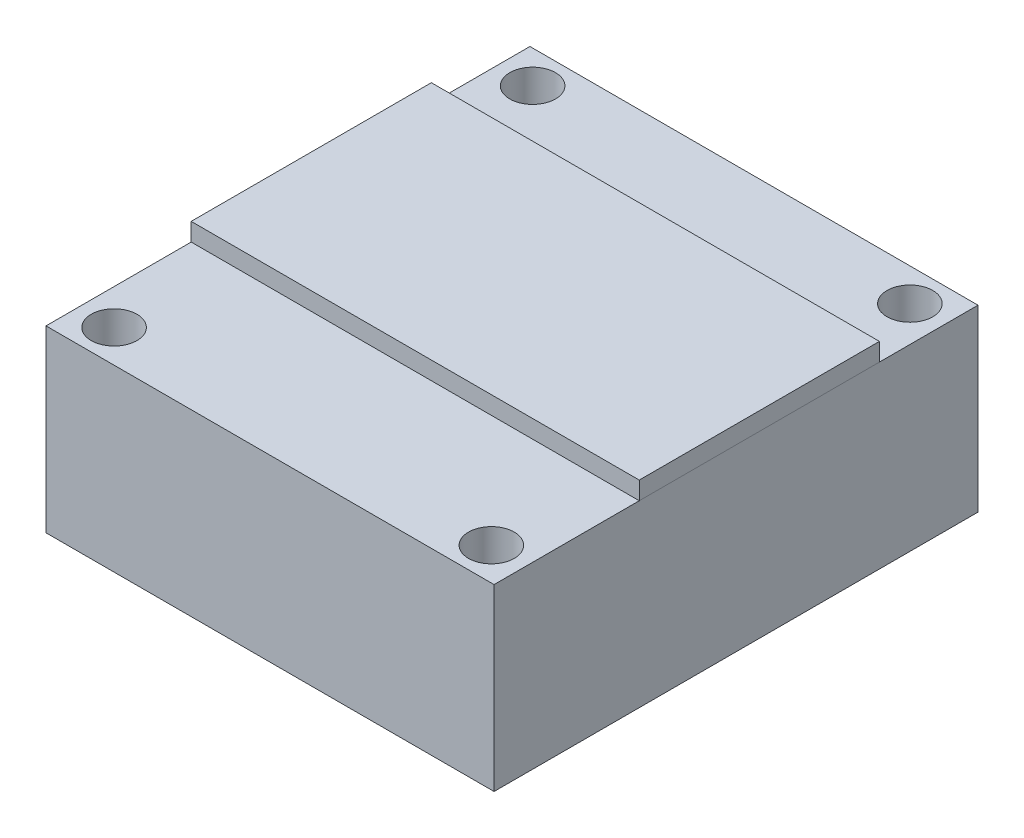
ISO-10303-21;
HEADER;
FILE_DESCRIPTION(('STEP AP214'),'2;1');
FILE_NAME('part.step','',(''),(''),'','','');
FILE_SCHEMA(('AUTOMOTIVE_DESIGN { 1 0 10303 214 1 1 1 1 }'));
ENDSEC;
DATA;
#1=APPLICATION_CONTEXT('core data for automotive mechanical design processes');
#2=APPLICATION_PROTOCOL_DEFINITION('international standard','automotive_design',2000,#1);
#3=PRODUCT_CONTEXT('',#1,'mechanical');
#4=PRODUCT('Part','Part','',(#3));
#5=PRODUCT_RELATED_PRODUCT_CATEGORY('part','',(#4));
#6=PRODUCT_DEFINITION_FORMATION('','',#4);
#7=PRODUCT_DEFINITION_CONTEXT('part definition',#1,'design');
#8=PRODUCT_DEFINITION('design','',#6,#7);
#9=PRODUCT_DEFINITION_SHAPE('','',#8);
#10=(LENGTH_UNIT() NAMED_UNIT(*) SI_UNIT(.MILLI.,.METRE.));
#11=(NAMED_UNIT(*) PLANE_ANGLE_UNIT() SI_UNIT($,.RADIAN.));
#12=(NAMED_UNIT(*) SI_UNIT($,.STERADIAN.) SOLID_ANGLE_UNIT());
#13=UNCERTAINTY_MEASURE_WITH_UNIT(LENGTH_MEASURE(1.E-05),#10,'distance_accuracy_value','');
#14=(GEOMETRIC_REPRESENTATION_CONTEXT(3) GLOBAL_UNCERTAINTY_ASSIGNED_CONTEXT((#13)) GLOBAL_UNIT_ASSIGNED_CONTEXT((#10,
#11,#12)) REPRESENTATION_CONTEXT('',''));
#15=CARTESIAN_POINT('',(0.,0.,0.));
#16=DIRECTION('',(0.,0.,1.));
#17=DIRECTION('',(1.,0.,0.));
#18=AXIS2_PLACEMENT_3D('',#15,#16,#17);
#19=CARTESIAN_POINT('',(77.1591269636206,11.,33.7846010335148));
#20=DIRECTION('',(-1.,0.,0.));
#21=DIRECTION('',(0.,0.,1.));
#22=AXIS2_PLACEMENT_3D('',#19,#20,#21);
#23=PLANE('',#22);
#24=DIRECTION('',(0.,0.,-1.));
#25=VECTOR('',#24,1.);
#26=CARTESIAN_POINT('',(77.1591269636206,10.,33.7846010335148));
#27=LINE('',#26,#25);
#28=CARTESIAN_POINT('',(77.1591269636206,10.,33.7846010335148));
#29=VERTEX_POINT('',#28);
#30=CARTESIAN_POINT('',(77.1591269636206,10.,20.3846010335148));
#31=VERTEX_POINT('',#30);
#32=EDGE_CURVE('E120',#29,#31,#27,.T.);
#33=ORIENTED_EDGE('',*,*,#32,.T.);
#34=DIRECTION('',(0.,-1.,0.));
#35=VECTOR('',#34,1.);
#36=CARTESIAN_POINT('',(77.1591269636206,11.,20.3846010335148));
#37=LINE('',#36,#35);
#38=CARTESIAN_POINT('',(77.1591269636206,11.,20.3846010335148));
#39=VERTEX_POINT('',#38);
#40=EDGE_CURVE('E12',#39,#31,#37,.T.);
#41=ORIENTED_EDGE('',*,*,#40,.F.);
#42=DIRECTION('',(0.,0.,-1.));
#43=VECTOR('',#42,1.);
#44=CARTESIAN_POINT('',(77.1591269636206,11.,33.7846010335148));
#45=LINE('',#44,#43);
#46=CARTESIAN_POINT('',(77.1591269636206,11.,33.7846010335148));
#47=VERTEX_POINT('',#46);
#48=EDGE_CURVE('E108',#47,#39,#45,.T.);
#49=ORIENTED_EDGE('',*,*,#48,.F.);
#50=DIRECTION('',(0.,-1.,0.));
#51=VECTOR('',#50,1.);
#52=CARTESIAN_POINT('',(77.1591269636206,11.,33.7846010335148));
#53=LINE('',#52,#51);
#54=EDGE_CURVE('E116',#47,#29,#53,.T.);
#55=ORIENTED_EDGE('',*,*,#54,.T.);
#56=EDGE_LOOP('',(#33,#41,#49,#55));
#57=FACE_BOUND('',#56,.T.);
#58=ADVANCED_FACE('F57',(#57),#23,.F.);
#59=CARTESIAN_POINT('',(52.1591269636206,11.,20.3846010335148));
#60=DIRECTION('',(0.,0.,1.));
#61=DIRECTION('',(1.,0.,0.));
#62=AXIS2_PLACEMENT_3D('',#59,#60,#61);
#63=PLANE('',#62);
#64=DIRECTION('',(-1.,0.,0.));
#65=VECTOR('',#64,1.);
#66=CARTESIAN_POINT('',(52.1591269636206,10.,20.3846010335148));
#67=LINE('',#66,#65);
#68=CARTESIAN_POINT('',(52.1591269636206,10.,20.3846010335148));
#69=VERTEX_POINT('',#68);
#70=EDGE_CURVE('E112',#31,#69,#67,.T.);
#71=ORIENTED_EDGE('',*,*,#70,.T.);
#72=DIRECTION('',(0.,-1.,0.));
#73=VECTOR('',#72,1.);
#74=CARTESIAN_POINT('',(52.1591269636206,11.,20.3846010335148));
#75=LINE('',#74,#73);
#76=CARTESIAN_POINT('',(52.1591269636206,11.,20.3846010335148));
#77=VERTEX_POINT('',#76);
#78=EDGE_CURVE('E65',#77,#69,#75,.T.);
#79=ORIENTED_EDGE('',*,*,#78,.F.);
#80=DIRECTION('',(-1.,0.,0.));
#81=VECTOR('',#80,1.);
#82=CARTESIAN_POINT('',(52.1591269636206,11.,20.3846010335148));
#83=LINE('',#82,#81);
#84=EDGE_CURVE('E103',#39,#77,#83,.T.);
#85=ORIENTED_EDGE('',*,*,#84,.F.);
#86=ORIENTED_EDGE('',*,*,#40,.T.);
#87=EDGE_LOOP('',(#71,#79,#85,#86));
#88=FACE_BOUND('',#87,.T.);
#89=ADVANCED_FACE('F111',(#88),#63,.F.);
#90=CARTESIAN_POINT('',(52.1591269636206,11.,33.7846010335148));
#91=DIRECTION('',(1.,0.,0.));
#92=DIRECTION('',(0.,0.,-1.));
#93=AXIS2_PLACEMENT_3D('',#90,#91,#92);
#94=PLANE('',#93);
#95=DIRECTION('',(0.,0.,1.));
#96=VECTOR('',#95,1.);
#97=CARTESIAN_POINT('',(52.1591269636206,10.,33.7846010335148));
#98=LINE('',#97,#96);
#99=CARTESIAN_POINT('',(52.1591269636206,10.,33.7846010335148));
#100=VERTEX_POINT('',#99);
#101=EDGE_CURVE('E90',#69,#100,#98,.T.);
#102=ORIENTED_EDGE('',*,*,#101,.T.);
#103=DIRECTION('',(0.,-1.,0.));
#104=VECTOR('',#103,1.);
#105=CARTESIAN_POINT('',(52.1591269636206,11.,33.7846010335148));
#106=LINE('',#105,#104);
#107=CARTESIAN_POINT('',(52.1591269636206,11.,33.7846010335148));
#108=VERTEX_POINT('',#107);
#109=EDGE_CURVE('E113',#108,#100,#106,.T.);
#110=ORIENTED_EDGE('',*,*,#109,.F.);
#111=DIRECTION('',(0.,0.,1.));
#112=VECTOR('',#111,1.);
#113=CARTESIAN_POINT('',(52.1591269636206,11.,33.7846010335148));
#114=LINE('',#113,#112);
#115=EDGE_CURVE('E106',#77,#108,#114,.T.);
#116=ORIENTED_EDGE('',*,*,#115,.F.);
#117=ORIENTED_EDGE('',*,*,#78,.T.);
#118=EDGE_LOOP('',(#102,#110,#116,#117));
#119=FACE_BOUND('',#118,.T.);
#120=ADVANCED_FACE('F114',(#119),#94,.F.);
#121=CARTESIAN_POINT('',(52.1591269636206,11.,33.7846010335148));
#122=DIRECTION('',(0.,0.,-1.));
#123=DIRECTION('',(-1.,0.,0.));
#124=AXIS2_PLACEMENT_3D('',#121,#122,#123);
#125=PLANE('',#124);
#126=DIRECTION('',(1.,0.,0.));
#127=VECTOR('',#126,1.);
#128=CARTESIAN_POINT('',(52.1591269636206,10.,33.7846010335148));
#129=LINE('',#128,#127);
#130=EDGE_CURVE('E96',#100,#29,#129,.T.);
#131=ORIENTED_EDGE('',*,*,#130,.T.);
#132=ORIENTED_EDGE('',*,*,#54,.F.);
#133=DIRECTION('',(1.,0.,0.));
#134=VECTOR('',#133,1.);
#135=CARTESIAN_POINT('',(52.1591269636206,11.,33.7846010335148));
#136=LINE('',#135,#134);
#137=EDGE_CURVE('E73',#108,#47,#136,.T.);
#138=ORIENTED_EDGE('',*,*,#137,.F.);
#139=ORIENTED_EDGE('',*,*,#109,.T.);
#140=EDGE_LOOP('',(#131,#132,#138,#139));
#141=FACE_BOUND('',#140,.T.);
#142=ADVANCED_FACE('F127',(#141),#125,.F.);
#143=CARTESIAN_POINT('',(0.,11.,0.));
#144=DIRECTION('',(0.,-1.,0.));
#145=DIRECTION('',(0.,0.,-1.));
#146=AXIS2_PLACEMENT_3D('',#143,#144,#145);
#147=PLANE('',#146);
#148=ORIENTED_EDGE('',*,*,#48,.T.);
#149=ORIENTED_EDGE('',*,*,#84,.T.);
#150=ORIENTED_EDGE('',*,*,#115,.T.);
#151=ORIENTED_EDGE('',*,*,#137,.T.);
#152=EDGE_LOOP('',(#148,#149,#150,#151));
#153=FACE_BOUND('',#152,.T.);
#154=ADVANCED_FACE('F104',(#153),#147,.F.);
#155=CARTESIAN_POINT('',(0.,10.,0.));
#156=DIRECTION('',(0.,-1.,0.));
#157=DIRECTION('',(0.,0.,-1.));
#158=AXIS2_PLACEMENT_3D('',#155,#156,#157);
#159=PLANE('',#158);
#160=ORIENTED_EDGE('',*,*,#32,.F.);
#161=ORIENTED_EDGE('',*,*,#130,.F.);
#162=ORIENTED_EDGE('',*,*,#101,.F.);
#163=ORIENTED_EDGE('',*,*,#70,.F.);
#164=EDGE_LOOP('',(#160,#161,#162,#163));
#165=FACE_BOUND('',#164,.T.);
#166=ADVANCED_FACE('F130',(#165),#159,.T.);
#167=CLOSED_SHELL('',(#58,#89,#120,#142,#154,#166));
#168=MANIFOLD_SOLID_BREP('B2',#167);
#169=CARTESIAN_POINT('',(0.,10.,0.));
#170=DIRECTION('',(0.,1.,0.));
#171=DIRECTION('',(0.,0.,1.));
#172=AXIS2_PLACEMENT_3D('',#169,#170,#171);
#173=PLANE('',#172);
#174=CARTESIAN_POINT('',(75.1841269636205,10.,40.0596010335148));
#175=DIRECTION('',(0.,1.,0.));
#176=DIRECTION('',(0.,0.,1.));
#177=AXIS2_PLACEMENT_3D('',#174,#175,#176);
#178=CIRCLE('',#177,1.275);
#179=CARTESIAN_POINT('',(75.1841269636205,10.,41.3346010335148));
#180=VERTEX_POINT('',#179);
#181=EDGE_CURVE('E284',#180,#180,#178,.T.);
#182=ORIENTED_EDGE('',*,*,#181,.F.);
#183=EDGE_LOOP('',(#182));
#184=FACE_BOUND('',#183,.T.);
#185=CARTESIAN_POINT('',(54.1341269636206,10.,16.7096010335148));
#186=DIRECTION('',(0.,1.,0.));
#187=DIRECTION('',(0.,0.,1.));
#188=AXIS2_PLACEMENT_3D('',#185,#186,#187);
#189=CIRCLE('',#188,1.275);
#190=CARTESIAN_POINT('',(54.1341269636206,10.,17.9846010335148));
#191=VERTEX_POINT('',#190);
#192=EDGE_CURVE('E254',#191,#191,#189,.T.);
#193=ORIENTED_EDGE('',*,*,#192,.F.);
#194=EDGE_LOOP('',(#193));
#195=FACE_BOUND('',#194,.T.);
#196=DIRECTION('',(0.,0.,-1.));
#197=VECTOR('',#196,1.);
#198=CARTESIAN_POINT('',(77.1591269636206,10.,14.8846010335148));
#199=LINE('',#198,#197);
#200=CARTESIAN_POINT('',(77.1591269636206,10.,41.8846010335148));
#201=VERTEX_POINT('',#200);
#202=CARTESIAN_POINT('',(77.1591269636206,10.,14.8846010335148));
#203=VERTEX_POINT('',#202);
#204=EDGE_CURVE('E234',#201,#203,#199,.T.);
#205=ORIENTED_EDGE('',*,*,#204,.T.);
#206=DIRECTION('',(-1.,0.,0.));
#207=VECTOR('',#206,1.);
#208=CARTESIAN_POINT('',(52.1591269636206,10.,14.8846010335148));
#209=LINE('',#208,#207);
#210=CARTESIAN_POINT('',(52.1591269636206,10.,14.8846010335148));
#211=VERTEX_POINT('',#210);
#212=EDGE_CURVE('E229',#203,#211,#209,.T.);
#213=ORIENTED_EDGE('',*,*,#212,.T.);
#214=DIRECTION('',(0.,0.,1.));
#215=VECTOR('',#214,1.);
#216=CARTESIAN_POINT('',(52.1591269636206,10.,14.8846010335148));
#217=LINE('',#216,#215);
#218=CARTESIAN_POINT('',(52.1591269636206,10.,41.8846010335148));
#219=VERTEX_POINT('',#218);
#220=EDGE_CURVE('E232',#211,#219,#217,.T.);
#221=ORIENTED_EDGE('',*,*,#220,.T.);
#222=DIRECTION('',(1.,0.,0.));
#223=VECTOR('',#222,1.);
#224=CARTESIAN_POINT('',(52.1591269636206,10.,41.8846010335148));
#225=LINE('',#224,#223);
#226=EDGE_CURVE('E199',#219,#201,#225,.T.);
#227=ORIENTED_EDGE('',*,*,#226,.T.);
#228=EDGE_LOOP('',(#205,#213,#221,#227));
#229=FACE_BOUND('',#228,.T.);
#230=CARTESIAN_POINT('',(54.1341269636206,10.,40.0596010335148));
#231=DIRECTION('',(0.,1.,0.));
#232=DIRECTION('',(0.,0.,-1.));
#233=AXIS2_PLACEMENT_3D('',#230,#231,#232);
#234=CIRCLE('',#233,1.275);
#235=CARTESIAN_POINT('',(54.1341269636206,10.,38.7846010335148));
#236=VERTEX_POINT('',#235);
#237=EDGE_CURVE('E276',#236,#236,#234,.T.);
#238=ORIENTED_EDGE('',*,*,#237,.F.);
#239=EDGE_LOOP('',(#238));
#240=FACE_BOUND('',#239,.T.);
#241=CARTESIAN_POINT('',(75.1841269636205,10.,16.7096010335148));
#242=DIRECTION('',(0.,1.,0.));
#243=DIRECTION('',(0.,0.,-1.));
#244=AXIS2_PLACEMENT_3D('',#241,#242,#243);
#245=CIRCLE('',#244,1.275);
#246=CARTESIAN_POINT('',(75.1841269636205,10.,15.4346010335148));
#247=VERTEX_POINT('',#246);
#248=EDGE_CURVE('E292',#247,#247,#245,.T.);
#249=ORIENTED_EDGE('',*,*,#248,.F.);
#250=EDGE_LOOP('',(#249));
#251=FACE_BOUND('',#250,.T.);
#252=ADVANCED_FACE('F181',(#184,#195,#229,#240,#251),#173,.T.);
#253=CARTESIAN_POINT('',(0.,0.,0.));
#254=DIRECTION('',(0.,1.,0.));
#255=DIRECTION('',(0.,0.,1.));
#256=AXIS2_PLACEMENT_3D('',#253,#254,#255);
#257=PLANE('',#256);
#258=DIRECTION('',(0.,0.,-1.));
#259=VECTOR('',#258,1.);
#260=CARTESIAN_POINT('',(77.1591269636206,0.,14.8846010335148));
#261=LINE('',#260,#259);
#262=CARTESIAN_POINT('',(77.1591269636206,0.,41.8846010335148));
#263=VERTEX_POINT('',#262);
#264=CARTESIAN_POINT('',(77.1591269636206,0.,14.8846010335148));
#265=VERTEX_POINT('',#264);
#266=EDGE_CURVE('E250',#263,#265,#261,.T.);
#267=ORIENTED_EDGE('',*,*,#266,.F.);
#268=DIRECTION('',(1.,0.,0.));
#269=VECTOR('',#268,1.);
#270=CARTESIAN_POINT('',(52.1591269636206,0.,41.8846010335148));
#271=LINE('',#270,#269);
#272=CARTESIAN_POINT('',(52.1591269636206,0.,41.8846010335148));
#273=VERTEX_POINT('',#272);
#274=EDGE_CURVE('E222',#273,#263,#271,.T.);
#275=ORIENTED_EDGE('',*,*,#274,.F.);
#276=DIRECTION('',(0.,0.,1.));
#277=VECTOR('',#276,1.);
#278=CARTESIAN_POINT('',(52.1591269636206,0.,14.8846010335148));
#279=LINE('',#278,#277);
#280=CARTESIAN_POINT('',(52.1591269636206,0.,14.8846010335148));
#281=VERTEX_POINT('',#280);
#282=EDGE_CURVE('E216',#281,#273,#279,.T.);
#283=ORIENTED_EDGE('',*,*,#282,.F.);
#284=DIRECTION('',(-1.,0.,0.));
#285=VECTOR('',#284,1.);
#286=CARTESIAN_POINT('',(52.1591269636206,0.,14.8846010335148));
#287=LINE('',#286,#285);
#288=EDGE_CURVE('E239',#265,#281,#287,.T.);
#289=ORIENTED_EDGE('',*,*,#288,.F.);
#290=EDGE_LOOP('',(#267,#275,#283,#289));
#291=FACE_BOUND('',#290,.T.);
#292=CARTESIAN_POINT('',(54.1341269636206,0.,16.7096010335148));
#293=DIRECTION('',(0.,1.,0.));
#294=DIRECTION('',(0.,0.,1.));
#295=AXIS2_PLACEMENT_3D('',#292,#293,#294);
#296=CIRCLE('',#295,1.275);
#297=CARTESIAN_POINT('',(54.1341269636206,0.,17.9846010335148));
#298=VERTEX_POINT('',#297);
#299=EDGE_CURVE('E272',#298,#298,#296,.T.);
#300=ORIENTED_EDGE('',*,*,#299,.T.);
#301=EDGE_LOOP('',(#300));
#302=FACE_BOUND('',#301,.T.);
#303=CARTESIAN_POINT('',(54.1341269636206,0.,40.0596010335148));
#304=DIRECTION('',(0.,1.,0.));
#305=DIRECTION('',(0.,0.,-1.));
#306=AXIS2_PLACEMENT_3D('',#303,#304,#305);
#307=CIRCLE('',#306,1.275);
#308=CARTESIAN_POINT('',(54.1341269636206,0.,38.7846010335148));
#309=VERTEX_POINT('',#308);
#310=EDGE_CURVE('E280',#309,#309,#307,.T.);
#311=ORIENTED_EDGE('',*,*,#310,.T.);
#312=EDGE_LOOP('',(#311));
#313=FACE_BOUND('',#312,.T.);
#314=CARTESIAN_POINT('',(75.1841269636205,0.,40.0596010335148));
#315=DIRECTION('',(0.,1.,0.));
#316=DIRECTION('',(0.,0.,1.));
#317=AXIS2_PLACEMENT_3D('',#314,#315,#316);
#318=CIRCLE('',#317,1.275);
#319=CARTESIAN_POINT('',(75.1841269636205,0.,41.3346010335148));
#320=VERTEX_POINT('',#319);
#321=EDGE_CURVE('E288',#320,#320,#318,.T.);
#322=ORIENTED_EDGE('',*,*,#321,.T.);
#323=EDGE_LOOP('',(#322));
#324=FACE_BOUND('',#323,.T.);
#325=CARTESIAN_POINT('',(75.1841269636205,0.,16.7096010335148));
#326=DIRECTION('',(0.,1.,0.));
#327=DIRECTION('',(0.,0.,-1.));
#328=AXIS2_PLACEMENT_3D('',#325,#326,#327);
#329=CIRCLE('',#328,1.275);
#330=CARTESIAN_POINT('',(75.1841269636205,0.,15.4346010335148));
#331=VERTEX_POINT('',#330);
#332=EDGE_CURVE('E296',#331,#331,#329,.T.);
#333=ORIENTED_EDGE('',*,*,#332,.T.);
#334=EDGE_LOOP('',(#333));
#335=FACE_BOUND('',#334,.T.);
#336=ADVANCED_FACE('F267',(#291,#302,#313,#324,#335),#257,.F.);
#337=CARTESIAN_POINT('',(77.1591269636206,10.,14.8846010335148));
#338=DIRECTION('',(-1.,0.,0.));
#339=DIRECTION('',(0.,0.,1.));
#340=AXIS2_PLACEMENT_3D('',#337,#338,#339);
#341=PLANE('',#340);
#342=ORIENTED_EDGE('',*,*,#266,.T.);
#343=DIRECTION('',(0.,-1.,0.));
#344=VECTOR('',#343,1.);
#345=CARTESIAN_POINT('',(77.1591269636206,10.,14.8846010335148));
#346=LINE('',#345,#344);
#347=EDGE_CURVE('E55',#203,#265,#346,.T.);
#348=ORIENTED_EDGE('',*,*,#347,.F.);
#349=ORIENTED_EDGE('',*,*,#204,.F.);
#350=DIRECTION('',(0.,-1.,0.));
#351=VECTOR('',#350,1.);
#352=CARTESIAN_POINT('',(77.1591269636206,10.,41.8846010335148));
#353=LINE('',#352,#351);
#354=EDGE_CURVE('E246',#201,#263,#353,.T.);
#355=ORIENTED_EDGE('',*,*,#354,.T.);
#356=EDGE_LOOP('',(#342,#348,#349,#355));
#357=FACE_BOUND('',#356,.T.);
#358=ADVANCED_FACE('F183',(#357),#341,.F.);
#359=CARTESIAN_POINT('',(52.1591269636206,10.,14.8846010335148));
#360=DIRECTION('',(0.,0.,1.));
#361=DIRECTION('',(1.,0.,0.));
#362=AXIS2_PLACEMENT_3D('',#359,#360,#361);
#363=PLANE('',#362);
#364=ORIENTED_EDGE('',*,*,#288,.T.);
#365=DIRECTION('',(0.,-1.,0.));
#366=VECTOR('',#365,1.);
#367=CARTESIAN_POINT('',(52.1591269636206,10.,14.8846010335148));
#368=LINE('',#367,#366);
#369=EDGE_CURVE('E191',#211,#281,#368,.T.);
#370=ORIENTED_EDGE('',*,*,#369,.F.);
#371=ORIENTED_EDGE('',*,*,#212,.F.);
#372=ORIENTED_EDGE('',*,*,#347,.T.);
#373=EDGE_LOOP('',(#364,#370,#371,#372));
#374=FACE_BOUND('',#373,.T.);
#375=ADVANCED_FACE('F238',(#374),#363,.F.);
#376=CARTESIAN_POINT('',(52.1591269636206,10.,14.8846010335148));
#377=DIRECTION('',(1.,0.,0.));
#378=DIRECTION('',(0.,0.,-1.));
#379=AXIS2_PLACEMENT_3D('',#376,#377,#378);
#380=PLANE('',#379);
#381=ORIENTED_EDGE('',*,*,#282,.T.);
#382=DIRECTION('',(0.,-1.,0.));
#383=VECTOR('',#382,1.);
#384=CARTESIAN_POINT('',(52.1591269636206,10.,41.8846010335148));
#385=LINE('',#384,#383);
#386=EDGE_CURVE('E241',#219,#273,#385,.T.);
#387=ORIENTED_EDGE('',*,*,#386,.F.);
#388=ORIENTED_EDGE('',*,*,#220,.F.);
#389=ORIENTED_EDGE('',*,*,#369,.T.);
#390=EDGE_LOOP('',(#381,#387,#388,#389));
#391=FACE_BOUND('',#390,.T.);
#392=ADVANCED_FACE('F242',(#391),#380,.F.);
#393=CARTESIAN_POINT('',(52.1591269636206,10.,41.8846010335148));
#394=DIRECTION('',(0.,0.,-1.));
#395=DIRECTION('',(-1.,0.,0.));
#396=AXIS2_PLACEMENT_3D('',#393,#394,#395);
#397=PLANE('',#396);
#398=ORIENTED_EDGE('',*,*,#274,.T.);
#399=ORIENTED_EDGE('',*,*,#354,.F.);
#400=ORIENTED_EDGE('',*,*,#226,.F.);
#401=ORIENTED_EDGE('',*,*,#386,.T.);
#402=EDGE_LOOP('',(#398,#399,#400,#401));
#403=FACE_BOUND('',#402,.T.);
#404=ADVANCED_FACE('F264',(#403),#397,.F.);
#405=CARTESIAN_POINT('',(54.1341269636206,10.,16.7096010335148));
#406=DIRECTION('',(0.,-1.,0.));
#407=DIRECTION('',(0.,0.,-1.));
#408=AXIS2_PLACEMENT_3D('',#405,#406,#407);
#409=CYLINDRICAL_SURFACE('',#408,1.275);
#410=ORIENTED_EDGE('',*,*,#192,.T.);
#411=EDGE_LOOP('',(#410));
#412=FACE_BOUND('',#411,.T.);
#413=ORIENTED_EDGE('',*,*,#299,.F.);
#414=EDGE_LOOP('',(#413));
#415=FACE_BOUND('',#414,.T.);
#416=ADVANCED_FACE('F317',(#412,#415),#409,.F.);
#417=CARTESIAN_POINT('',(54.1341269636206,10.,40.0596010335148));
#418=DIRECTION('',(0.,-1.,0.));
#419=DIRECTION('',(0.,0.,-1.));
#420=AXIS2_PLACEMENT_3D('',#417,#418,#419);
#421=CYLINDRICAL_SURFACE('',#420,1.275);
#422=ORIENTED_EDGE('',*,*,#237,.T.);
#423=EDGE_LOOP('',(#422));
#424=FACE_BOUND('',#423,.T.);
#425=ORIENTED_EDGE('',*,*,#310,.F.);
#426=EDGE_LOOP('',(#425));
#427=FACE_BOUND('',#426,.T.);
#428=ADVANCED_FACE('F362',(#424,#427),#421,.F.);
#429=CARTESIAN_POINT('',(75.1841269636205,10.,40.0596010335148));
#430=DIRECTION('',(0.,-1.,0.));
#431=DIRECTION('',(0.,0.,-1.));
#432=AXIS2_PLACEMENT_3D('',#429,#430,#431);
#433=CYLINDRICAL_SURFACE('',#432,1.275);
#434=ORIENTED_EDGE('',*,*,#181,.T.);
#435=EDGE_LOOP('',(#434));
#436=FACE_BOUND('',#435,.T.);
#437=ORIENTED_EDGE('',*,*,#321,.F.);
#438=EDGE_LOOP('',(#437));
#439=FACE_BOUND('',#438,.T.);
#440=ADVANCED_FACE('F370',(#436,#439),#433,.F.);
#441=CARTESIAN_POINT('',(75.1841269636205,10.,16.7096010335148));
#442=DIRECTION('',(0.,-1.,0.));
#443=DIRECTION('',(0.,0.,-1.));
#444=AXIS2_PLACEMENT_3D('',#441,#442,#443);
#445=CYLINDRICAL_SURFACE('',#444,1.275);
#446=ORIENTED_EDGE('',*,*,#248,.T.);
#447=EDGE_LOOP('',(#446));
#448=FACE_BOUND('',#447,.T.);
#449=ORIENTED_EDGE('',*,*,#332,.F.);
#450=EDGE_LOOP('',(#449));
#451=FACE_BOUND('',#450,.T.);
#452=ADVANCED_FACE('F304',(#448,#451),#445,.F.);
#453=CLOSED_SHELL('',(#252,#336,#358,#375,#392,#404,#416,#428,#440,#452));
#454=MANIFOLD_SOLID_BREP('B6',#453);
#455=ADVANCED_BREP_SHAPE_REPRESENTATION('',(#18,#168,#454),#14);
#456=SHAPE_DEFINITION_REPRESENTATION(#9,#455);
ENDSEC;
END-ISO-10303-21;
